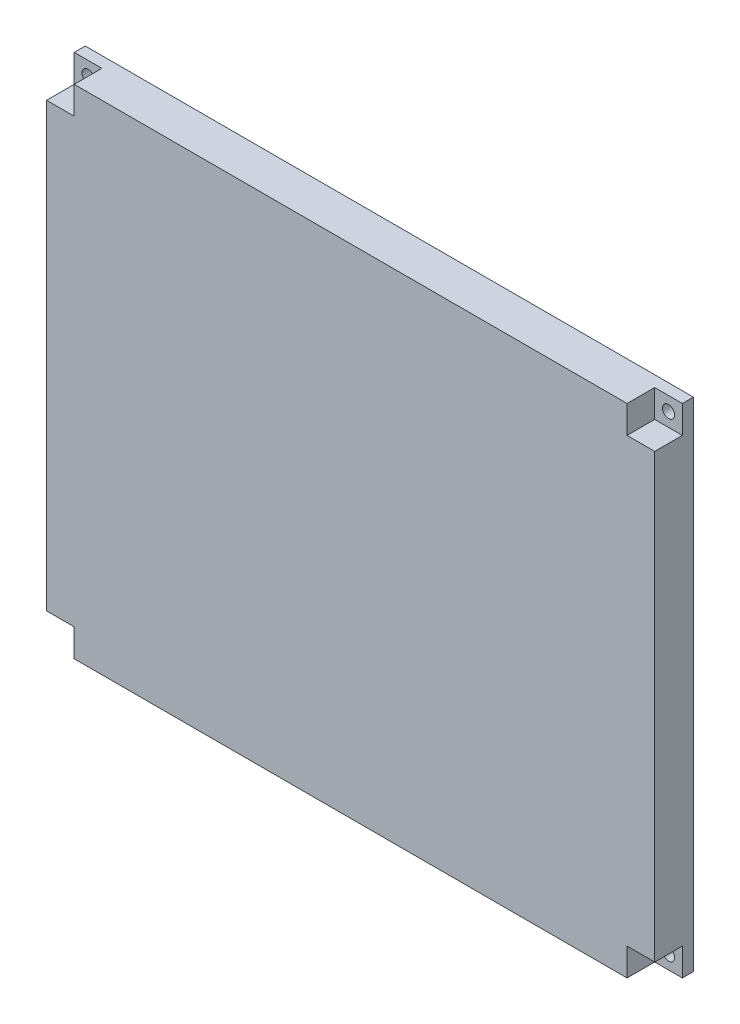
ISO-10303-21;
HEADER;
FILE_DESCRIPTION(('STEP AP214'),'2;1');
FILE_NAME('part.step','',(''),(''),'','','');
FILE_SCHEMA(('AUTOMOTIVE_DESIGN { 1 0 10303 214 1 1 1 1 }'));
ENDSEC;
DATA;
#1=APPLICATION_CONTEXT('core data for automotive mechanical design processes');
#2=APPLICATION_PROTOCOL_DEFINITION('international standard','automotive_design',2000,#1);
#3=PRODUCT_CONTEXT('',#1,'mechanical');
#4=PRODUCT('Part','Part','',(#3));
#5=PRODUCT_RELATED_PRODUCT_CATEGORY('part','',(#4));
#6=PRODUCT_DEFINITION_FORMATION('','',#4);
#7=PRODUCT_DEFINITION_CONTEXT('part definition',#1,'design');
#8=PRODUCT_DEFINITION('design','',#6,#7);
#9=PRODUCT_DEFINITION_SHAPE('','',#8);
#10=(LENGTH_UNIT() NAMED_UNIT(*) SI_UNIT(.MILLI.,.METRE.));
#11=(NAMED_UNIT(*) PLANE_ANGLE_UNIT() SI_UNIT($,.RADIAN.));
#12=(NAMED_UNIT(*) SI_UNIT($,.STERADIAN.) SOLID_ANGLE_UNIT());
#13=UNCERTAINTY_MEASURE_WITH_UNIT(LENGTH_MEASURE(1.E-05),#10,'distance_accuracy_value','');
#14=(GEOMETRIC_REPRESENTATION_CONTEXT(3) GLOBAL_UNCERTAINTY_ASSIGNED_CONTEXT((#13)) GLOBAL_UNIT_ASSIGNED_CONTEXT((#10,
#11,#12)) REPRESENTATION_CONTEXT('',''));
#15=CARTESIAN_POINT('',(0.,0.,0.));
#16=DIRECTION('',(0.,0.,1.));
#17=DIRECTION('',(1.,0.,0.));
#18=AXIS2_PLACEMENT_3D('',#15,#16,#17);
#19=CARTESIAN_POINT('',(-89.0867155495886,42.9813664596273,10.));
#20=DIRECTION('',(0.,1.,0.));
#21=DIRECTION('',(0.,0.,1.));
#22=AXIS2_PLACEMENT_3D('',#19,#20,#21);
#23=PLANE('',#22);
#24=DIRECTION('',(1.,0.,0.));
#25=VECTOR('',#24,1.);
#26=CARTESIAN_POINT('',(-84.0867155495887,42.9813664596273,3.));
#27=LINE('',#26,#25);
#28=CARTESIAN_POINT('',(-84.0867155495886,42.9813664596273,3.));
#29=VERTEX_POINT('',#28);
#30=CARTESIAN_POINT('',(25.9132844504113,42.9813664596273,3.));
#31=VERTEX_POINT('',#30);
#32=EDGE_CURVE('E173',#29,#31,#27,.T.);
#33=ORIENTED_EDGE('',*,*,#32,.F.);
#34=DIRECTION('',(0.,0.,-1.));
#35=VECTOR('',#34,1.);
#36=CARTESIAN_POINT('',(-84.0867155495886,42.9813664596273,3.));
#37=LINE('',#36,#35);
#38=CARTESIAN_POINT('',(-84.0867155495886,42.9813664596273,5.));
#39=VERTEX_POINT('',#38);
#40=EDGE_CURVE('E56',#39,#29,#37,.T.);
#41=ORIENTED_EDGE('',*,*,#40,.F.);
#42=DIRECTION('',(-1.,0.,0.));
#43=VECTOR('',#42,1.);
#44=CARTESIAN_POINT('',(-84.0867155495886,42.9813664596273,5.));
#45=LINE('',#44,#43);
#46=CARTESIAN_POINT('',(-79.0867155495886,42.9813664596273,5.));
#47=VERTEX_POINT('',#46);
#48=EDGE_CURVE('E261',#47,#39,#45,.T.);
#49=ORIENTED_EDGE('',*,*,#48,.F.);
#50=DIRECTION('',(0.,0.,1.));
#51=VECTOR('',#50,1.);
#52=CARTESIAN_POINT('',(-79.0867155495886,42.9813664596273,5.));
#53=LINE('',#52,#51);
#54=CARTESIAN_POINT('',(-79.0867155495886,42.9813664596273,10.));
#55=VERTEX_POINT('',#54);
#56=EDGE_CURVE('E268',#47,#55,#53,.T.);
#57=ORIENTED_EDGE('',*,*,#56,.T.);
#58=DIRECTION('',(1.,0.,0.));
#59=VECTOR('',#58,1.);
#60=CARTESIAN_POINT('',(-89.0867155495886,42.9813664596273,10.));
#61=LINE('',#60,#59);
#62=CARTESIAN_POINT('',(20.9132844504113,42.9813664596273,10.));
#63=VERTEX_POINT('',#62);
#64=EDGE_CURVE('E48',#55,#63,#61,.T.);
#65=ORIENTED_EDGE('',*,*,#64,.T.);
#66=DIRECTION('',(0.,0.,1.));
#67=VECTOR('',#66,1.);
#68=CARTESIAN_POINT('',(20.9132844504113,42.9813664596273,5.));
#69=LINE('',#68,#67);
#70=CARTESIAN_POINT('',(20.9132844504113,42.9813664596273,5.));
#71=VERTEX_POINT('',#70);
#72=EDGE_CURVE('E219',#71,#63,#69,.T.);
#73=ORIENTED_EDGE('',*,*,#72,.F.);
#74=DIRECTION('',(-1.,0.,0.));
#75=VECTOR('',#74,1.);
#76=CARTESIAN_POINT('',(25.9132844504113,42.9813664596273,5.));
#77=LINE('',#76,#75);
#78=CARTESIAN_POINT('',(25.9132844504113,42.9813664596273,5.));
#79=VERTEX_POINT('',#78);
#80=EDGE_CURVE('E209',#79,#71,#77,.T.);
#81=ORIENTED_EDGE('',*,*,#80,.F.);
#82=DIRECTION('',(0.,0.,1.));
#83=VECTOR('',#82,1.);
#84=CARTESIAN_POINT('',(25.9132844504113,42.9813664596273,3.));
#85=LINE('',#84,#83);
#86=EDGE_CURVE('E301',#31,#79,#85,.T.);
#87=ORIENTED_EDGE('',*,*,#86,.F.);
#88=EDGE_LOOP('',(#33,#41,#49,#57,#65,#73,#81,#87));
#89=FACE_BOUND('',#88,.T.);
#90=ADVANCED_FACE('F40',(#89),#23,.T.);
#91=CARTESIAN_POINT('',(-89.0867155495886,-47.0186335403727,10.));
#92=DIRECTION('',(0.,1.,0.));
#93=DIRECTION('',(0.,0.,1.));
#94=AXIS2_PLACEMENT_3D('',#91,#92,#93);
#95=PLANE('',#94);
#96=DIRECTION('',(0.,0.,1.));
#97=VECTOR('',#96,1.);
#98=CARTESIAN_POINT('',(-84.0867155495886,-47.0186335403727,3.));
#99=LINE('',#98,#97);
#100=CARTESIAN_POINT('',(-84.0867155495886,-47.0186335403727,3.));
#101=VERTEX_POINT('',#100);
#102=CARTESIAN_POINT('',(-84.0867155495886,-47.0186335403727,5.));
#103=VERTEX_POINT('',#102);
#104=EDGE_CURVE('E155',#101,#103,#99,.T.);
#105=ORIENTED_EDGE('',*,*,#104,.F.);
#106=DIRECTION('',(-1.,0.,0.));
#107=VECTOR('',#106,1.);
#108=CARTESIAN_POINT('',(25.9132844504114,-47.0186335403726,3.));
#109=LINE('',#108,#107);
#110=CARTESIAN_POINT('',(25.9132844504114,-47.0186335403726,3.));
#111=VERTEX_POINT('',#110);
#112=EDGE_CURVE('E165',#111,#101,#109,.T.);
#113=ORIENTED_EDGE('',*,*,#112,.F.);
#114=DIRECTION('',(0.,0.,-1.));
#115=VECTOR('',#114,1.);
#116=CARTESIAN_POINT('',(25.9132844504114,-47.0186335403727,3.));
#117=LINE('',#116,#115);
#118=CARTESIAN_POINT('',(25.9132844504114,-47.0186335403727,5.));
#119=VERTEX_POINT('',#118);
#120=EDGE_CURVE('E64',#119,#111,#117,.T.);
#121=ORIENTED_EDGE('',*,*,#120,.F.);
#122=DIRECTION('',(1.,0.,0.));
#123=VECTOR('',#122,1.);
#124=CARTESIAN_POINT('',(25.9132844504113,-47.0186335403727,5.));
#125=LINE('',#124,#123);
#126=CARTESIAN_POINT('',(20.9132844504113,-47.0186335403727,5.));
#127=VERTEX_POINT('',#126);
#128=EDGE_CURVE('E181',#127,#119,#125,.T.);
#129=ORIENTED_EDGE('',*,*,#128,.F.);
#130=DIRECTION('',(0.,0.,1.));
#131=VECTOR('',#130,1.);
#132=CARTESIAN_POINT('',(20.9132844504113,-47.0186335403727,5.));
#133=LINE('',#132,#131);
#134=CARTESIAN_POINT('',(20.9132844504113,-47.0186335403727,10.));
#135=VERTEX_POINT('',#134);
#136=EDGE_CURVE('E198',#127,#135,#133,.T.);
#137=ORIENTED_EDGE('',*,*,#136,.T.);
#138=DIRECTION('',(1.,0.,0.));
#139=VECTOR('',#138,1.);
#140=CARTESIAN_POINT('',(-89.0867155495886,-47.0186335403727,10.));
#141=LINE('',#140,#139);
#142=CARTESIAN_POINT('',(-79.0867155495886,-47.0186335403727,10.));
#143=VERTEX_POINT('',#142);
#144=EDGE_CURVE('E11',#143,#135,#141,.T.);
#145=ORIENTED_EDGE('',*,*,#144,.F.);
#146=DIRECTION('',(0.,0.,1.));
#147=VECTOR('',#146,1.);
#148=CARTESIAN_POINT('',(-79.0867155495886,-47.0186335403727,5.));
#149=LINE('',#148,#147);
#150=CARTESIAN_POINT('',(-79.0867155495886,-47.0186335403727,5.));
#151=VERTEX_POINT('',#150);
#152=EDGE_CURVE('E242',#151,#143,#149,.T.);
#153=ORIENTED_EDGE('',*,*,#152,.F.);
#154=DIRECTION('',(1.,0.,0.));
#155=VECTOR('',#154,1.);
#156=CARTESIAN_POINT('',(-84.0867155495886,-47.0186335403726,5.));
#157=LINE('',#156,#155);
#158=EDGE_CURVE('E168',#103,#151,#157,.T.);
#159=ORIENTED_EDGE('',*,*,#158,.F.);
#160=EDGE_LOOP('',(#105,#113,#121,#129,#137,#145,#153,#159));
#161=FACE_BOUND('',#160,.T.);
#162=ADVANCED_FACE('F164',(#161),#95,.F.);
#163=CARTESIAN_POINT('',(0.,0.,10.));
#164=DIRECTION('',(0.,0.,-1.));
#165=DIRECTION('',(-1.,0.,0.));
#166=AXIS2_PLACEMENT_3D('',#163,#164,#165);
#167=PLANE('',#166);
#168=DIRECTION('',(0.,1.,0.));
#169=VECTOR('',#168,1.);
#170=CARTESIAN_POINT('',(-84.0867155495886,42.9813664596273,10.));
#171=LINE('',#170,#169);
#172=CARTESIAN_POINT('',(-84.0867155495886,-42.0186335403727,10.));
#173=VERTEX_POINT('',#172);
#174=CARTESIAN_POINT('',(-84.0867155495886,37.9813664596273,10.));
#175=VERTEX_POINT('',#174);
#176=EDGE_CURVE('E169',#173,#175,#171,.T.);
#177=ORIENTED_EDGE('',*,*,#176,.F.);
#178=DIRECTION('',(-1.,0.,0.));
#179=VECTOR('',#178,1.);
#180=CARTESIAN_POINT('',(-84.0867155495886,-42.0186335403727,10.));
#181=LINE('',#180,#179);
#182=CARTESIAN_POINT('',(-79.0867155495886,-42.0186335403727,10.));
#183=VERTEX_POINT('',#182);
#184=EDGE_CURVE('E234',#183,#173,#181,.T.);
#185=ORIENTED_EDGE('',*,*,#184,.F.);
#186=DIRECTION('',(0.,1.,0.));
#187=VECTOR('',#186,1.);
#188=CARTESIAN_POINT('',(-79.0867155495886,-47.0186335403727,10.));
#189=LINE('',#188,#187);
#190=EDGE_CURVE('E201',#143,#183,#189,.T.);
#191=ORIENTED_EDGE('',*,*,#190,.F.);
#192=ORIENTED_EDGE('',*,*,#144,.T.);
#193=DIRECTION('',(0.,-1.,0.));
#194=VECTOR('',#193,1.);
#195=CARTESIAN_POINT('',(20.9132844504113,-47.0186335403727,10.));
#196=LINE('',#195,#194);
#197=CARTESIAN_POINT('',(20.9132844504113,-42.0186335403727,10.));
#198=VERTEX_POINT('',#197);
#199=EDGE_CURVE('E185',#198,#135,#196,.T.);
#200=ORIENTED_EDGE('',*,*,#199,.F.);
#201=DIRECTION('',(-1.,0.,0.));
#202=VECTOR('',#201,1.);
#203=CARTESIAN_POINT('',(25.9132844504113,-42.0186335403727,10.));
#204=LINE('',#203,#202);
#205=CARTESIAN_POINT('',(25.9132844504114,-42.0186335403727,10.));
#206=VERTEX_POINT('',#205);
#207=EDGE_CURVE('E176',#206,#198,#204,.T.);
#208=ORIENTED_EDGE('',*,*,#207,.F.);
#209=DIRECTION('',(0.,-1.,0.));
#210=VECTOR('',#209,1.);
#211=CARTESIAN_POINT('',(25.9132844504113,42.9813664596273,10.));
#212=LINE('',#211,#210);
#213=CARTESIAN_POINT('',(25.9132844504113,37.9813664596273,10.));
#214=VERTEX_POINT('',#213);
#215=EDGE_CURVE('E299',#214,#206,#212,.T.);
#216=ORIENTED_EDGE('',*,*,#215,.F.);
#217=DIRECTION('',(1.,0.,0.));
#218=VECTOR('',#217,1.);
#219=CARTESIAN_POINT('',(25.9132844504113,37.9813664596273,10.));
#220=LINE('',#219,#218);
#221=CARTESIAN_POINT('',(20.9132844504113,37.9813664596273,10.));
#222=VERTEX_POINT('',#221);
#223=EDGE_CURVE('E210',#222,#214,#220,.T.);
#224=ORIENTED_EDGE('',*,*,#223,.F.);
#225=DIRECTION('',(0.,-1.,0.));
#226=VECTOR('',#225,1.);
#227=CARTESIAN_POINT('',(20.9132844504113,42.9813664596273,10.));
#228=LINE('',#227,#226);
#229=EDGE_CURVE('E220',#63,#222,#228,.T.);
#230=ORIENTED_EDGE('',*,*,#229,.F.);
#231=ORIENTED_EDGE('',*,*,#64,.F.);
#232=DIRECTION('',(0.,1.,0.));
#233=VECTOR('',#232,1.);
#234=CARTESIAN_POINT('',(-79.0867155495886,42.9813664596273,10.));
#235=LINE('',#234,#233);
#236=CARTESIAN_POINT('',(-79.0867155495886,37.9813664596273,10.));
#237=VERTEX_POINT('',#236);
#238=EDGE_CURVE('E255',#237,#55,#235,.T.);
#239=ORIENTED_EDGE('',*,*,#238,.F.);
#240=DIRECTION('',(1.,0.,0.));
#241=VECTOR('',#240,1.);
#242=CARTESIAN_POINT('',(-84.0867155495886,37.9813664596273,10.));
#243=LINE('',#242,#241);
#244=EDGE_CURVE('E228',#175,#237,#243,.T.);
#245=ORIENTED_EDGE('',*,*,#244,.F.);
#246=EDGE_LOOP('',(#177,#185,#191,#192,#200,#208,#216,#224,#230,#231,#239,#245));
#247=FACE_BOUND('',#246,.T.);
#248=ADVANCED_FACE('F314',(#247),#167,.F.);
#249=CARTESIAN_POINT('',(0.,0.,3.));
#250=DIRECTION('',(0.,0.,1.));
#251=DIRECTION('',(1.,0.,0.));
#252=AXIS2_PLACEMENT_3D('',#249,#250,#251);
#253=PLANE('',#252);
#254=CARTESIAN_POINT('',(23.4132844504114,40.4813664596273,3.));
#255=DIRECTION('',(0.,0.,-1.));
#256=DIRECTION('',(-1.,0.,0.));
#257=AXIS2_PLACEMENT_3D('',#254,#255,#256);
#258=CIRCLE('',#257,1.1);
#259=CARTESIAN_POINT('',(22.3132844504114,40.4813664596273,3.));
#260=VERTEX_POINT('',#259);
#261=EDGE_CURVE('E43',#260,#260,#258,.T.);
#262=ORIENTED_EDGE('',*,*,#261,.F.);
#263=EDGE_LOOP('',(#262));
#264=FACE_BOUND('',#263,.T.);
#265=CARTESIAN_POINT('',(-81.5867155495887,40.4813664596273,3.));
#266=DIRECTION('',(0.,0.,1.));
#267=DIRECTION('',(1.,0.,0.));
#268=AXIS2_PLACEMENT_3D('',#265,#266,#267);
#269=CIRCLE('',#268,1.1);
#270=CARTESIAN_POINT('',(-80.4867155495887,40.4813664596273,3.));
#271=VERTEX_POINT('',#270);
#272=EDGE_CURVE('E284',#271,#271,#269,.T.);
#273=ORIENTED_EDGE('',*,*,#272,.T.);
#274=EDGE_LOOP('',(#273));
#275=FACE_BOUND('',#274,.T.);
#276=CARTESIAN_POINT('',(-81.5867155495887,-44.5186335403726,3.));
#277=DIRECTION('',(0.,0.,1.));
#278=DIRECTION('',(1.,0.,0.));
#279=AXIS2_PLACEMENT_3D('',#276,#277,#278);
#280=CIRCLE('',#279,1.1);
#281=CARTESIAN_POINT('',(-80.4867155495887,-44.5186335403726,3.));
#282=VERTEX_POINT('',#281);
#283=EDGE_CURVE('E281',#282,#282,#280,.T.);
#284=ORIENTED_EDGE('',*,*,#283,.T.);
#285=EDGE_LOOP('',(#284));
#286=FACE_BOUND('',#285,.T.);
#287=CARTESIAN_POINT('',(23.4132844504114,-44.5186335403726,3.));
#288=DIRECTION('',(0.,0.,1.));
#289=DIRECTION('',(1.,0.,0.));
#290=AXIS2_PLACEMENT_3D('',#287,#288,#289);
#291=CIRCLE('',#290,1.1);
#292=CARTESIAN_POINT('',(24.5132844504114,-44.5186335403726,3.));
#293=VERTEX_POINT('',#292);
#294=EDGE_CURVE('E277',#293,#293,#291,.T.);
#295=ORIENTED_EDGE('',*,*,#294,.T.);
#296=EDGE_LOOP('',(#295));
#297=FACE_BOUND('',#296,.T.);
#298=DIRECTION('',(0.,-1.,0.));
#299=VECTOR('',#298,1.);
#300=CARTESIAN_POINT('',(-84.0867155495886,42.9813664596273,3.));
#301=LINE('',#300,#299);
#302=EDGE_CURVE('E152',#29,#101,#301,.T.);
#303=ORIENTED_EDGE('',*,*,#302,.F.);
#304=ORIENTED_EDGE('',*,*,#32,.T.);
#305=DIRECTION('',(0.,1.,0.));
#306=VECTOR('',#305,1.);
#307=CARTESIAN_POINT('',(25.9132844504113,42.9813664596273,3.));
#308=LINE('',#307,#306);
#309=EDGE_CURVE('E172',#111,#31,#308,.T.);
#310=ORIENTED_EDGE('',*,*,#309,.F.);
#311=ORIENTED_EDGE('',*,*,#112,.T.);
#312=EDGE_LOOP('',(#303,#304,#310,#311));
#313=FACE_BOUND('',#312,.T.);
#314=ADVANCED_FACE('F171',(#264,#275,#286,#297,#313),#253,.F.);
#315=CARTESIAN_POINT('',(-79.0867155495886,42.9813664596273,5.));
#316=DIRECTION('',(1.,0.,0.));
#317=DIRECTION('',(0.,0.,-1.));
#318=AXIS2_PLACEMENT_3D('',#315,#316,#317);
#319=PLANE('',#318);
#320=ORIENTED_EDGE('',*,*,#238,.T.);
#321=ORIENTED_EDGE('',*,*,#56,.F.);
#322=DIRECTION('',(0.,1.,0.));
#323=VECTOR('',#322,1.);
#324=CARTESIAN_POINT('',(-79.0867155495886,42.9813664596273,5.));
#325=LINE('',#324,#323);
#326=CARTESIAN_POINT('',(-79.0867155495886,37.9813664596273,5.));
#327=VERTEX_POINT('',#326);
#328=EDGE_CURVE('E258',#327,#47,#325,.T.);
#329=ORIENTED_EDGE('',*,*,#328,.F.);
#330=DIRECTION('',(0.,0.,1.));
#331=VECTOR('',#330,1.);
#332=CARTESIAN_POINT('',(-79.0867155495886,37.9813664596273,5.));
#333=LINE('',#332,#331);
#334=EDGE_CURVE('E271',#327,#237,#333,.T.);
#335=ORIENTED_EDGE('',*,*,#334,.T.);
#336=EDGE_LOOP('',(#320,#321,#329,#335));
#337=FACE_BOUND('',#336,.T.);
#338=ADVANCED_FACE('F318',(#337),#319,.F.);
#339=CARTESIAN_POINT('',(-84.0867155495886,37.9813664596273,5.));
#340=DIRECTION('',(0.,-1.,0.));
#341=DIRECTION('',(0.,0.,-1.));
#342=AXIS2_PLACEMENT_3D('',#339,#340,#341);
#343=PLANE('',#342);
#344=ORIENTED_EDGE('',*,*,#244,.T.);
#345=ORIENTED_EDGE('',*,*,#334,.F.);
#346=DIRECTION('',(1.,0.,0.));
#347=VECTOR('',#346,1.);
#348=CARTESIAN_POINT('',(-84.0867155495886,37.9813664596273,5.));
#349=LINE('',#348,#347);
#350=CARTESIAN_POINT('',(-84.0867155495886,37.9813664596273,5.));
#351=VERTEX_POINT('',#350);
#352=EDGE_CURVE('E254',#351,#327,#349,.T.);
#353=ORIENTED_EDGE('',*,*,#352,.F.);
#354=DIRECTION('',(0.,0.,1.));
#355=VECTOR('',#354,1.);
#356=CARTESIAN_POINT('',(-84.0867155495886,37.9813664596273,5.));
#357=LINE('',#356,#355);
#358=EDGE_CURVE('E264',#351,#175,#357,.T.);
#359=ORIENTED_EDGE('',*,*,#358,.T.);
#360=EDGE_LOOP('',(#344,#345,#353,#359));
#361=FACE_BOUND('',#360,.T.);
#362=ADVANCED_FACE('F312',(#361),#343,.F.);
#363=CARTESIAN_POINT('',(0.,0.,5.));
#364=DIRECTION('',(0.,0.,1.));
#365=DIRECTION('',(1.,0.,0.));
#366=AXIS2_PLACEMENT_3D('',#363,#364,#365);
#367=PLANE('',#366);
#368=CARTESIAN_POINT('',(-81.5867155495887,40.4813664596273,5.));
#369=DIRECTION('',(0.,0.,1.));
#370=DIRECTION('',(1.,0.,0.));
#371=AXIS2_PLACEMENT_3D('',#368,#369,#370);
#372=CIRCLE('',#371,1.1);
#373=CARTESIAN_POINT('',(-80.4867155495887,40.4813664596273,5.));
#374=VERTEX_POINT('',#373);
#375=EDGE_CURVE('E286',#374,#374,#372,.T.);
#376=ORIENTED_EDGE('',*,*,#375,.F.);
#377=EDGE_LOOP('',(#376));
#378=FACE_BOUND('',#377,.T.);
#379=DIRECTION('',(0.,-1.,0.));
#380=VECTOR('',#379,1.);
#381=CARTESIAN_POINT('',(-84.0867155495886,42.9813664596273,5.));
#382=LINE('',#381,#380);
#383=EDGE_CURVE('E251',#39,#351,#382,.T.);
#384=ORIENTED_EDGE('',*,*,#383,.T.);
#385=ORIENTED_EDGE('',*,*,#352,.T.);
#386=ORIENTED_EDGE('',*,*,#328,.T.);
#387=ORIENTED_EDGE('',*,*,#48,.T.);
#388=EDGE_LOOP('',(#384,#385,#386,#387));
#389=FACE_BOUND('',#388,.T.);
#390=ADVANCED_FACE('F324',(#378,#389),#367,.T.);
#391=CARTESIAN_POINT('',(20.9132844504113,-47.0186335403727,5.));
#392=DIRECTION('',(-1.,0.,0.));
#393=DIRECTION('',(0.,0.,1.));
#394=AXIS2_PLACEMENT_3D('',#391,#392,#393);
#395=PLANE('',#394);
#396=ORIENTED_EDGE('',*,*,#199,.T.);
#397=ORIENTED_EDGE('',*,*,#136,.F.);
#398=DIRECTION('',(0.,-1.,0.));
#399=VECTOR('',#398,1.);
#400=CARTESIAN_POINT('',(20.9132844504113,-47.0186335403727,5.));
#401=LINE('',#400,#399);
#402=CARTESIAN_POINT('',(20.9132844504113,-42.0186335403727,5.));
#403=VERTEX_POINT('',#402);
#404=EDGE_CURVE('E191',#403,#127,#401,.T.);
#405=ORIENTED_EDGE('',*,*,#404,.F.);
#406=DIRECTION('',(0.,0.,1.));
#407=VECTOR('',#406,1.);
#408=CARTESIAN_POINT('',(20.9132844504113,-42.0186335403727,5.));
#409=LINE('',#408,#407);
#410=EDGE_CURVE('E202',#403,#198,#409,.T.);
#411=ORIENTED_EDGE('',*,*,#410,.T.);
#412=EDGE_LOOP('',(#396,#397,#405,#411));
#413=FACE_BOUND('',#412,.T.);
#414=ADVANCED_FACE('F326',(#413),#395,.F.);
#415=CARTESIAN_POINT('',(25.9132844504113,-42.0186335403727,5.));
#416=DIRECTION('',(0.,1.,0.));
#417=DIRECTION('',(0.,0.,1.));
#418=AXIS2_PLACEMENT_3D('',#415,#416,#417);
#419=PLANE('',#418);
#420=ORIENTED_EDGE('',*,*,#207,.T.);
#421=ORIENTED_EDGE('',*,*,#410,.F.);
#422=DIRECTION('',(-1.,0.,0.));
#423=VECTOR('',#422,1.);
#424=CARTESIAN_POINT('',(25.9132844504113,-42.0186335403727,5.));
#425=LINE('',#424,#423);
#426=CARTESIAN_POINT('',(25.9132844504114,-42.0186335403727,5.));
#427=VERTEX_POINT('',#426);
#428=EDGE_CURVE('E188',#427,#403,#425,.T.);
#429=ORIENTED_EDGE('',*,*,#428,.F.);
#430=DIRECTION('',(0.,0.,1.));
#431=VECTOR('',#430,1.);
#432=CARTESIAN_POINT('',(25.9132844504113,-42.0186335403727,5.));
#433=LINE('',#432,#431);
#434=EDGE_CURVE('E194',#427,#206,#433,.T.);
#435=ORIENTED_EDGE('',*,*,#434,.T.);
#436=EDGE_LOOP('',(#420,#421,#429,#435));
#437=FACE_BOUND('',#436,.T.);
#438=ADVANCED_FACE('F333',(#437),#419,.F.);
#439=CARTESIAN_POINT('',(0.,0.,5.));
#440=DIRECTION('',(0.,0.,-1.));
#441=DIRECTION('',(-1.,0.,0.));
#442=AXIS2_PLACEMENT_3D('',#439,#440,#441);
#443=PLANE('',#442);
#444=CARTESIAN_POINT('',(23.4132844504114,-44.5186335403726,5.));
#445=DIRECTION('',(0.,0.,-1.));
#446=DIRECTION('',(-1.,0.,0.));
#447=AXIS2_PLACEMENT_3D('',#444,#445,#446);
#448=CIRCLE('',#447,1.1);
#449=CARTESIAN_POINT('',(22.3132844504114,-44.5186335403726,5.));
#450=VERTEX_POINT('',#449);
#451=EDGE_CURVE('E280',#450,#450,#448,.T.);
#452=ORIENTED_EDGE('',*,*,#451,.T.);
#453=EDGE_LOOP('',(#452));
#454=FACE_BOUND('',#453,.T.);
#455=ORIENTED_EDGE('',*,*,#128,.T.);
#456=DIRECTION('',(0.,1.,0.));
#457=VECTOR('',#456,1.);
#458=CARTESIAN_POINT('',(25.9132844504113,-47.0186335403727,5.));
#459=LINE('',#458,#457);
#460=EDGE_CURVE('E184',#119,#427,#459,.T.);
#461=ORIENTED_EDGE('',*,*,#460,.T.);
#462=ORIENTED_EDGE('',*,*,#428,.T.);
#463=ORIENTED_EDGE('',*,*,#404,.T.);
#464=EDGE_LOOP('',(#455,#461,#462,#463));
#465=FACE_BOUND('',#464,.T.);
#466=ADVANCED_FACE('F361',(#454,#465),#443,.F.);
#467=CARTESIAN_POINT('',(-84.0867155495886,-42.0186335403727,5.));
#468=DIRECTION('',(0.,1.,0.));
#469=DIRECTION('',(0.,0.,1.));
#470=AXIS2_PLACEMENT_3D('',#467,#468,#469);
#471=PLANE('',#470);
#472=ORIENTED_EDGE('',*,*,#184,.T.);
#473=DIRECTION('',(0.,0.,1.));
#474=VECTOR('',#473,1.);
#475=CARTESIAN_POINT('',(-84.0867155495886,-42.0186335403727,5.));
#476=LINE('',#475,#474);
#477=CARTESIAN_POINT('',(-84.0867155495886,-42.0186335403727,5.));
#478=VERTEX_POINT('',#477);
#479=EDGE_CURVE('E223',#478,#173,#476,.T.);
#480=ORIENTED_EDGE('',*,*,#479,.F.);
#481=DIRECTION('',(-1.,0.,0.));
#482=VECTOR('',#481,1.);
#483=CARTESIAN_POINT('',(-84.0867155495886,-42.0186335403727,5.));
#484=LINE('',#483,#482);
#485=CARTESIAN_POINT('',(-79.0867155495886,-42.0186335403727,5.));
#486=VERTEX_POINT('',#485);
#487=EDGE_CURVE('E239',#486,#478,#484,.T.);
#488=ORIENTED_EDGE('',*,*,#487,.F.);
#489=DIRECTION('',(0.,0.,1.));
#490=VECTOR('',#489,1.);
#491=CARTESIAN_POINT('',(-79.0867155495886,-42.0186335403727,5.));
#492=LINE('',#491,#490);
#493=EDGE_CURVE('E248',#486,#183,#492,.T.);
#494=ORIENTED_EDGE('',*,*,#493,.T.);
#495=EDGE_LOOP('',(#472,#480,#488,#494));
#496=FACE_BOUND('',#495,.T.);
#497=ADVANCED_FACE('F363',(#496),#471,.F.);
#498=CARTESIAN_POINT('',(-79.0867155495886,-47.0186335403727,5.));
#499=DIRECTION('',(1.,0.,0.));
#500=DIRECTION('',(0.,0.,-1.));
#501=AXIS2_PLACEMENT_3D('',#498,#499,#500);
#502=PLANE('',#501);
#503=ORIENTED_EDGE('',*,*,#190,.T.);
#504=ORIENTED_EDGE('',*,*,#493,.F.);
#505=DIRECTION('',(0.,1.,0.));
#506=VECTOR('',#505,1.);
#507=CARTESIAN_POINT('',(-79.0867155495886,-47.0186335403727,5.));
#508=LINE('',#507,#506);
#509=EDGE_CURVE('E236',#151,#486,#508,.T.);
#510=ORIENTED_EDGE('',*,*,#509,.F.);
#511=ORIENTED_EDGE('',*,*,#152,.T.);
#512=EDGE_LOOP('',(#503,#504,#510,#511));
#513=FACE_BOUND('',#512,.T.);
#514=ADVANCED_FACE('F385',(#513),#502,.F.);
#515=CARTESIAN_POINT('',(0.,0.,5.));
#516=DIRECTION('',(0.,0.,-1.));
#517=DIRECTION('',(-1.,0.,0.));
#518=AXIS2_PLACEMENT_3D('',#515,#516,#517);
#519=PLANE('',#518);
#520=CARTESIAN_POINT('',(-81.5867155495887,-44.5186335403726,5.));
#521=DIRECTION('',(0.,0.,-1.));
#522=DIRECTION('',(-1.,0.,0.));
#523=AXIS2_PLACEMENT_3D('',#520,#521,#522);
#524=CIRCLE('',#523,1.1);
#525=CARTESIAN_POINT('',(-82.6867155495887,-44.5186335403726,5.));
#526=VERTEX_POINT('',#525);
#527=EDGE_CURVE('E283',#526,#526,#524,.T.);
#528=ORIENTED_EDGE('',*,*,#527,.T.);
#529=EDGE_LOOP('',(#528));
#530=FACE_BOUND('',#529,.T.);
#531=DIRECTION('',(0.,-1.,0.));
#532=VECTOR('',#531,1.);
#533=CARTESIAN_POINT('',(-84.0867155495886,-47.0186335403726,5.));
#534=LINE('',#533,#532);
#535=EDGE_CURVE('E232',#478,#103,#534,.T.);
#536=ORIENTED_EDGE('',*,*,#535,.T.);
#537=ORIENTED_EDGE('',*,*,#158,.T.);
#538=ORIENTED_EDGE('',*,*,#509,.T.);
#539=ORIENTED_EDGE('',*,*,#487,.T.);
#540=EDGE_LOOP('',(#536,#537,#538,#539));
#541=FACE_BOUND('',#540,.T.);
#542=ADVANCED_FACE('F378',(#530,#541),#519,.F.);
#543=CARTESIAN_POINT('',(25.9132844504113,37.9813664596273,5.));
#544=DIRECTION('',(0.,-1.,0.));
#545=DIRECTION('',(0.,0.,-1.));
#546=AXIS2_PLACEMENT_3D('',#543,#544,#545);
#547=PLANE('',#546);
#548=ORIENTED_EDGE('',*,*,#223,.T.);
#549=DIRECTION('',(0.,0.,1.));
#550=VECTOR('',#549,1.);
#551=CARTESIAN_POINT('',(25.9132844504113,37.9813664596273,5.));
#552=LINE('',#551,#550);
#553=CARTESIAN_POINT('',(25.9132844504113,37.9813664596273,5.));
#554=VERTEX_POINT('',#553);
#555=EDGE_CURVE('E226',#554,#214,#552,.T.);
#556=ORIENTED_EDGE('',*,*,#555,.F.);
#557=DIRECTION('',(1.,0.,0.));
#558=VECTOR('',#557,1.);
#559=CARTESIAN_POINT('',(25.9132844504113,37.9813664596273,5.));
#560=LINE('',#559,#558);
#561=CARTESIAN_POINT('',(20.9132844504113,37.9813664596273,5.));
#562=VERTEX_POINT('',#561);
#563=EDGE_CURVE('E216',#562,#554,#560,.T.);
#564=ORIENTED_EDGE('',*,*,#563,.F.);
#565=DIRECTION('',(0.,0.,1.));
#566=VECTOR('',#565,1.);
#567=CARTESIAN_POINT('',(20.9132844504113,37.9813664596273,5.));
#568=LINE('',#567,#566);
#569=EDGE_CURVE('E229',#562,#222,#568,.T.);
#570=ORIENTED_EDGE('',*,*,#569,.T.);
#571=EDGE_LOOP('',(#548,#556,#564,#570));
#572=FACE_BOUND('',#571,.T.);
#573=ADVANCED_FACE('F375',(#572),#547,.F.);
#574=CARTESIAN_POINT('',(20.9132844504113,42.9813664596273,5.));
#575=DIRECTION('',(-1.,0.,0.));
#576=DIRECTION('',(0.,0.,1.));
#577=AXIS2_PLACEMENT_3D('',#574,#575,#576);
#578=PLANE('',#577);
#579=ORIENTED_EDGE('',*,*,#229,.T.);
#580=ORIENTED_EDGE('',*,*,#569,.F.);
#581=DIRECTION('',(0.,-1.,0.));
#582=VECTOR('',#581,1.);
#583=CARTESIAN_POINT('',(20.9132844504113,42.9813664596273,5.));
#584=LINE('',#583,#582);
#585=EDGE_CURVE('E213',#71,#562,#584,.T.);
#586=ORIENTED_EDGE('',*,*,#585,.F.);
#587=ORIENTED_EDGE('',*,*,#72,.T.);
#588=EDGE_LOOP('',(#579,#580,#586,#587));
#589=FACE_BOUND('',#588,.T.);
#590=ADVANCED_FACE('F373',(#589),#578,.F.);
#591=CARTESIAN_POINT('',(0.,0.,5.));
#592=DIRECTION('',(0.,0.,-1.));
#593=DIRECTION('',(-1.,0.,0.));
#594=AXIS2_PLACEMENT_3D('',#591,#592,#593);
#595=PLANE('',#594);
#596=CARTESIAN_POINT('',(23.4132844504114,40.4813664596273,5.));
#597=DIRECTION('',(0.,0.,-1.));
#598=DIRECTION('',(-1.,0.,0.));
#599=AXIS2_PLACEMENT_3D('',#596,#597,#598);
#600=CIRCLE('',#599,1.1);
#601=CARTESIAN_POINT('',(22.3132844504114,40.4813664596273,5.));
#602=VERTEX_POINT('',#601);
#603=EDGE_CURVE('E174',#602,#602,#600,.T.);
#604=ORIENTED_EDGE('',*,*,#603,.T.);
#605=EDGE_LOOP('',(#604));
#606=FACE_BOUND('',#605,.T.);
#607=DIRECTION('',(0.,1.,0.));
#608=VECTOR('',#607,1.);
#609=CARTESIAN_POINT('',(25.9132844504113,42.9813664596273,5.));
#610=LINE('',#609,#608);
#611=EDGE_CURVE('E206',#554,#79,#610,.T.);
#612=ORIENTED_EDGE('',*,*,#611,.T.);
#613=ORIENTED_EDGE('',*,*,#80,.T.);
#614=ORIENTED_EDGE('',*,*,#585,.T.);
#615=ORIENTED_EDGE('',*,*,#563,.T.);
#616=EDGE_LOOP('',(#612,#613,#614,#615));
#617=FACE_BOUND('',#616,.T.);
#618=ADVANCED_FACE('F369',(#606,#617),#595,.F.);
#619=CARTESIAN_POINT('',(23.4132844504114,-44.5186335403726,42.));
#620=DIRECTION('',(0.,0.,-1.));
#621=DIRECTION('',(-1.,0.,0.));
#622=AXIS2_PLACEMENT_3D('',#619,#620,#621);
#623=CYLINDRICAL_SURFACE('',#622,1.1);
#624=ORIENTED_EDGE('',*,*,#294,.F.);
#625=EDGE_LOOP('',(#624));
#626=FACE_BOUND('',#625,.T.);
#627=ORIENTED_EDGE('',*,*,#451,.F.);
#628=EDGE_LOOP('',(#627));
#629=FACE_BOUND('',#628,.T.);
#630=ADVANCED_FACE('F372',(#626,#629),#623,.F.);
#631=CARTESIAN_POINT('',(-81.5867155495887,-44.5186335403726,42.));
#632=DIRECTION('',(0.,0.,-1.));
#633=DIRECTION('',(-1.,0.,0.));
#634=AXIS2_PLACEMENT_3D('',#631,#632,#633);
#635=CYLINDRICAL_SURFACE('',#634,1.1);
#636=ORIENTED_EDGE('',*,*,#283,.F.);
#637=EDGE_LOOP('',(#636));
#638=FACE_BOUND('',#637,.T.);
#639=ORIENTED_EDGE('',*,*,#527,.F.);
#640=EDGE_LOOP('',(#639));
#641=FACE_BOUND('',#640,.T.);
#642=ADVANCED_FACE('F422',(#638,#641),#635,.F.);
#643=CARTESIAN_POINT('',(-81.5867155495887,40.4813664596273,42.));
#644=DIRECTION('',(0.,0.,-1.));
#645=DIRECTION('',(-1.,0.,0.));
#646=AXIS2_PLACEMENT_3D('',#643,#644,#645);
#647=CYLINDRICAL_SURFACE('',#646,1.1);
#648=ORIENTED_EDGE('',*,*,#375,.T.);
#649=EDGE_LOOP('',(#648));
#650=FACE_BOUND('',#649,.T.);
#651=ORIENTED_EDGE('',*,*,#272,.F.);
#652=EDGE_LOOP('',(#651));
#653=FACE_BOUND('',#652,.T.);
#654=ADVANCED_FACE('F417',(#650,#653),#647,.F.);
#655=CARTESIAN_POINT('',(23.4132844504114,40.4813664596273,42.));
#656=DIRECTION('',(0.,0.,-1.));
#657=DIRECTION('',(-1.,0.,0.));
#658=AXIS2_PLACEMENT_3D('',#655,#656,#657);
#659=CYLINDRICAL_SURFACE('',#658,1.1);
#660=ORIENTED_EDGE('',*,*,#261,.T.);
#661=EDGE_LOOP('',(#660));
#662=FACE_BOUND('',#661,.T.);
#663=ORIENTED_EDGE('',*,*,#603,.F.);
#664=EDGE_LOOP('',(#663));
#665=FACE_BOUND('',#664,.T.);
#666=ADVANCED_FACE('F359',(#662,#665),#659,.F.);
#667=CARTESIAN_POINT('',(25.9132844504114,0.,0.));
#668=DIRECTION('',(-1.,0.,0.));
#669=DIRECTION('',(0.,-1.,0.));
#670=AXIS2_PLACEMENT_3D('',#667,#668,#669);
#671=PLANE('',#670);
#672=ORIENTED_EDGE('',*,*,#460,.F.);
#673=ORIENTED_EDGE('',*,*,#120,.T.);
#674=ORIENTED_EDGE('',*,*,#309,.T.);
#675=ORIENTED_EDGE('',*,*,#86,.T.);
#676=ORIENTED_EDGE('',*,*,#611,.F.);
#677=ORIENTED_EDGE('',*,*,#555,.T.);
#678=ORIENTED_EDGE('',*,*,#215,.T.);
#679=ORIENTED_EDGE('',*,*,#434,.F.);
#680=EDGE_LOOP('',(#672,#673,#674,#675,#676,#677,#678,#679));
#681=FACE_BOUND('',#680,.T.);
#682=ADVANCED_FACE('F402',(#681),#671,.F.);
#683=CARTESIAN_POINT('',(-84.0867155495886,0.,0.));
#684=DIRECTION('',(-1.,0.,0.));
#685=DIRECTION('',(0.,-1.,0.));
#686=AXIS2_PLACEMENT_3D('',#683,#684,#685);
#687=PLANE('',#686);
#688=ORIENTED_EDGE('',*,*,#358,.F.);
#689=ORIENTED_EDGE('',*,*,#383,.F.);
#690=ORIENTED_EDGE('',*,*,#40,.T.);
#691=ORIENTED_EDGE('',*,*,#302,.T.);
#692=ORIENTED_EDGE('',*,*,#104,.T.);
#693=ORIENTED_EDGE('',*,*,#535,.F.);
#694=ORIENTED_EDGE('',*,*,#479,.T.);
#695=ORIENTED_EDGE('',*,*,#176,.T.);
#696=EDGE_LOOP('',(#688,#689,#690,#691,#692,#693,#694,#695));
#697=FACE_BOUND('',#696,.T.);
#698=ADVANCED_FACE('F154',(#697),#687,.T.);
#699=CLOSED_SHELL('',(#90,#162,#248,#314,#338,#362,#390,#414,#438,#466,#497,#514,#542,#573,#590,
#618,#630,#642,#654,#666,#682,#698));
#700=MANIFOLD_SOLID_BREP('B2',#699);
#701=ADVANCED_BREP_SHAPE_REPRESENTATION('',(#18,#700),#14);
#702=SHAPE_DEFINITION_REPRESENTATION(#9,#701);
ENDSEC;
END-ISO-10303-21;
